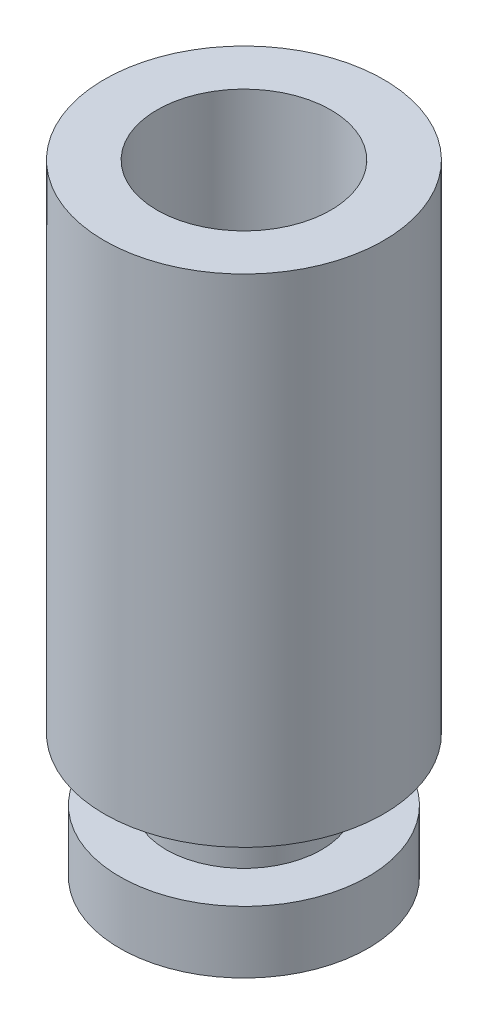
ISO-10303-21;
HEADER;
FILE_DESCRIPTION(('STEP AP214'),'2;1');
FILE_NAME('part.step','',(''),(''),'','','');
FILE_SCHEMA(('AUTOMOTIVE_DESIGN { 1 0 10303 214 1 1 1 1 }'));
ENDSEC;
DATA;
#1=APPLICATION_CONTEXT('core data for automotive mechanical design processes');
#2=APPLICATION_PROTOCOL_DEFINITION('international standard','automotive_design',2000,#1);
#3=PRODUCT_CONTEXT('',#1,'mechanical');
#4=PRODUCT('Part','Part','',(#3));
#5=PRODUCT_RELATED_PRODUCT_CATEGORY('part','',(#4));
#6=PRODUCT_DEFINITION_FORMATION('','',#4);
#7=PRODUCT_DEFINITION_CONTEXT('part definition',#1,'design');
#8=PRODUCT_DEFINITION('design','',#6,#7);
#9=PRODUCT_DEFINITION_SHAPE('','',#8);
#10=(LENGTH_UNIT() NAMED_UNIT(*) SI_UNIT(.MILLI.,.METRE.));
#11=(NAMED_UNIT(*) PLANE_ANGLE_UNIT() SI_UNIT($,.RADIAN.));
#12=(NAMED_UNIT(*) SI_UNIT($,.STERADIAN.) SOLID_ANGLE_UNIT());
#13=UNCERTAINTY_MEASURE_WITH_UNIT(LENGTH_MEASURE(1.E-05),#10,'distance_accuracy_value','');
#14=(GEOMETRIC_REPRESENTATION_CONTEXT(3) GLOBAL_UNCERTAINTY_ASSIGNED_CONTEXT((#13)) GLOBAL_UNIT_ASSIGNED_CONTEXT((#10,
#11,#12)) REPRESENTATION_CONTEXT('',''));
#15=CARTESIAN_POINT('',(0.,0.,0.));
#16=DIRECTION('',(0.,0.,1.));
#17=DIRECTION('',(1.,0.,0.));
#18=AXIS2_PLACEMENT_3D('',#15,#16,#17);
#19=CARTESIAN_POINT('',(-0.522013311509166,8.,-0.51113803418606));
#20=DIRECTION('',(0.,-1.,0.));
#21=DIRECTION('',(0.,0.,-1.));
#22=AXIS2_PLACEMENT_3D('',#19,#20,#21);
#23=CYLINDRICAL_SURFACE('',#22,2.25);
#24=CARTESIAN_POINT('',(-0.522013311509166,8.,-0.51113803418606));
#25=DIRECTION('',(0.,1.,0.));
#26=DIRECTION('',(0.,0.,1.));
#27=AXIS2_PLACEMENT_3D('',#24,#25,#26);
#28=CIRCLE('',#27,2.25);
#29=CARTESIAN_POINT('',(-0.522013311509166,8.,1.73886196581394));
#30=VERTEX_POINT('',#29);
#31=EDGE_CURVE('E53',#30,#30,#28,.T.);
#32=ORIENTED_EDGE('',*,*,#31,.F.);
#33=EDGE_LOOP('',(#32));
#34=FACE_BOUND('',#33,.T.);
#35=CARTESIAN_POINT('',(-0.522013311509166,0.,-0.51113803418606));
#36=DIRECTION('',(0.,1.,0.));
#37=DIRECTION('',(0.,0.,1.));
#38=AXIS2_PLACEMENT_3D('',#35,#36,#37);
#39=CIRCLE('',#38,2.25);
#40=CARTESIAN_POINT('',(-0.522013311509166,0.,1.73886196581394));
#41=VERTEX_POINT('',#40);
#42=EDGE_CURVE('E48',#41,#41,#39,.T.);
#43=ORIENTED_EDGE('',*,*,#42,.T.);
#44=EDGE_LOOP('',(#43));
#45=FACE_BOUND('',#44,.T.);
#46=ADVANCED_FACE('F45',(#34,#45),#23,.T.);
#47=CARTESIAN_POINT('',(-0.522013311509166,8.,-0.51113803418606));
#48=DIRECTION('',(0.,1.,0.));
#49=DIRECTION('',(0.,0.,1.));
#50=AXIS2_PLACEMENT_3D('',#47,#48,#49);
#51=PLANE('',#50);
#52=CARTESIAN_POINT('',(-0.522013311509166,8.,-0.51113803418606));
#53=DIRECTION('',(0.,1.,0.));
#54=DIRECTION('',(0.,0.,1.));
#55=AXIS2_PLACEMENT_3D('',#52,#53,#54);
#56=CIRCLE('',#55,1.4);
#57=CARTESIAN_POINT('',(-0.522013311509166,8.,0.88886196581394));
#58=VERTEX_POINT('',#57);
#59=EDGE_CURVE('E73',#58,#58,#56,.T.);
#60=ORIENTED_EDGE('',*,*,#59,.F.);
#61=EDGE_LOOP('',(#60));
#62=FACE_BOUND('',#61,.T.);
#63=ORIENTED_EDGE('',*,*,#31,.T.);
#64=EDGE_LOOP('',(#63));
#65=FACE_BOUND('',#64,.T.);
#66=ADVANCED_FACE('F90',(#62,#65),#51,.T.);
#67=CARTESIAN_POINT('',(-0.522013311509166,0.,-0.51113803418606));
#68=DIRECTION('',(0.,1.,0.));
#69=DIRECTION('',(0.,0.,1.));
#70=AXIS2_PLACEMENT_3D('',#67,#68,#69);
#71=PLANE('',#70);
#72=CARTESIAN_POINT('',(-0.522013311509166,0.,-0.51113803418606));
#73=DIRECTION('',(0.,-1.,0.));
#74=DIRECTION('',(0.,0.,-1.));
#75=AXIS2_PLACEMENT_3D('',#72,#73,#74);
#76=CIRCLE('',#75,1.25);
#77=CARTESIAN_POINT('',(-0.522013311509166,0.,-1.76113803418606));
#78=VERTEX_POINT('',#77);
#79=EDGE_CURVE('E10',#78,#78,#76,.T.);
#80=ORIENTED_EDGE('',*,*,#79,.F.);
#81=EDGE_LOOP('',(#80));
#82=FACE_BOUND('',#81,.T.);
#83=ORIENTED_EDGE('',*,*,#42,.F.);
#84=EDGE_LOOP('',(#83));
#85=FACE_BOUND('',#84,.T.);
#86=ADVANCED_FACE('F93',(#82,#85),#71,.F.);
#87=CARTESIAN_POINT('',(-0.522013311509166,-1.,-0.51113803418606));
#88=DIRECTION('',(0.,1.,0.));
#89=DIRECTION('',(0.,0.,1.));
#90=AXIS2_PLACEMENT_3D('',#87,#88,#89);
#91=CYLINDRICAL_SURFACE('',#90,1.25);
#92=CARTESIAN_POINT('',(-0.522013311509166,-1.,-0.51113803418606));
#93=DIRECTION('',(0.,-1.,0.));
#94=DIRECTION('',(0.,0.,-1.));
#95=AXIS2_PLACEMENT_3D('',#92,#93,#94);
#96=CIRCLE('',#95,1.25);
#97=CARTESIAN_POINT('',(-0.522013311509166,-1.,-1.76113803418606));
#98=VERTEX_POINT('',#97);
#99=EDGE_CURVE('E60',#98,#98,#96,.T.);
#100=ORIENTED_EDGE('',*,*,#99,.F.);
#101=EDGE_LOOP('',(#100));
#102=FACE_BOUND('',#101,.T.);
#103=ORIENTED_EDGE('',*,*,#79,.T.);
#104=EDGE_LOOP('',(#103));
#105=FACE_BOUND('',#104,.T.);
#106=ADVANCED_FACE('F104',(#102,#105),#91,.T.);
#107=CARTESIAN_POINT('',(-0.522013311509166,-2.,-0.51113803418606));
#108=DIRECTION('',(0.,1.,0.));
#109=DIRECTION('',(0.,0.,1.));
#110=AXIS2_PLACEMENT_3D('',#107,#108,#109);
#111=CYLINDRICAL_SURFACE('',#110,2.);
#112=CARTESIAN_POINT('',(-0.522013311509166,-2.,-0.51113803418606));
#113=DIRECTION('',(0.,-1.,0.));
#114=DIRECTION('',(0.,0.,-1.));
#115=AXIS2_PLACEMENT_3D('',#112,#113,#114);
#116=CIRCLE('',#115,2.);
#117=CARTESIAN_POINT('',(-0.522013311509166,-2.,-2.51113803418606));
#118=VERTEX_POINT('',#117);
#119=EDGE_CURVE('E64',#118,#118,#116,.T.);
#120=ORIENTED_EDGE('',*,*,#119,.F.);
#121=EDGE_LOOP('',(#120));
#122=FACE_BOUND('',#121,.T.);
#123=CARTESIAN_POINT('',(-0.522013311509166,-1.,-0.51113803418606));
#124=DIRECTION('',(0.,-1.,0.));
#125=DIRECTION('',(0.,0.,-1.));
#126=AXIS2_PLACEMENT_3D('',#123,#124,#125);
#127=CIRCLE('',#126,2.);
#128=CARTESIAN_POINT('',(-0.522013311509166,-1.,-2.51113803418606));
#129=VERTEX_POINT('',#128);
#130=EDGE_CURVE('E65',#129,#129,#127,.T.);
#131=ORIENTED_EDGE('',*,*,#130,.T.);
#132=EDGE_LOOP('',(#131));
#133=FACE_BOUND('',#132,.T.);
#134=ADVANCED_FACE('F109',(#122,#133),#111,.T.);
#135=CARTESIAN_POINT('',(-0.522013311509166,-2.,-0.51113803418606));
#136=DIRECTION('',(0.,-1.,0.));
#137=DIRECTION('',(0.,0.,-1.));
#138=AXIS2_PLACEMENT_3D('',#135,#136,#137);
#139=PLANE('',#138);
#140=ORIENTED_EDGE('',*,*,#119,.T.);
#141=EDGE_LOOP('',(#140));
#142=FACE_BOUND('',#141,.T.);
#143=ADVANCED_FACE('F115',(#142),#139,.T.);
#144=CARTESIAN_POINT('',(-0.522013311509166,-1.,-0.51113803418606));
#145=DIRECTION('',(0.,-1.,0.));
#146=DIRECTION('',(0.,0.,-1.));
#147=AXIS2_PLACEMENT_3D('',#144,#145,#146);
#148=PLANE('',#147);
#149=ORIENTED_EDGE('',*,*,#99,.T.);
#150=EDGE_LOOP('',(#149));
#151=FACE_BOUND('',#150,.T.);
#152=ORIENTED_EDGE('',*,*,#130,.F.);
#153=EDGE_LOOP('',(#152));
#154=FACE_BOUND('',#153,.T.);
#155=ADVANCED_FACE('F86',(#151,#154),#148,.F.);
#156=CARTESIAN_POINT('',(-0.522013311509166,0.5,-0.51113803418606));
#157=DIRECTION('',(0.,1.,0.));
#158=DIRECTION('',(0.,0.,1.));
#159=AXIS2_PLACEMENT_3D('',#156,#157,#158);
#160=CYLINDRICAL_SURFACE('',#159,1.4);
#161=CARTESIAN_POINT('',(-0.522013311509166,0.5,-0.51113803418606));
#162=DIRECTION('',(0.,1.,0.));
#163=DIRECTION('',(0.,0.,1.));
#164=AXIS2_PLACEMENT_3D('',#161,#162,#163);
#165=CIRCLE('',#164,1.4);
#166=CARTESIAN_POINT('',(-0.522013311509166,0.5,0.88886196581394));
#167=VERTEX_POINT('',#166);
#168=EDGE_CURVE('E69',#167,#167,#165,.T.);
#169=ORIENTED_EDGE('',*,*,#168,.F.);
#170=EDGE_LOOP('',(#169));
#171=FACE_BOUND('',#170,.T.);
#172=ORIENTED_EDGE('',*,*,#59,.T.);
#173=EDGE_LOOP('',(#172));
#174=FACE_BOUND('',#173,.T.);
#175=ADVANCED_FACE('F83',(#171,#174),#160,.F.);
#176=CARTESIAN_POINT('',(-0.522013311509166,0.5,-0.51113803418606));
#177=DIRECTION('',(0.,1.,0.));
#178=DIRECTION('',(0.,0.,1.));
#179=AXIS2_PLACEMENT_3D('',#176,#177,#178);
#180=PLANE('',#179);
#181=ORIENTED_EDGE('',*,*,#168,.T.);
#182=EDGE_LOOP('',(#181));
#183=FACE_BOUND('',#182,.T.);
#184=ADVANCED_FACE('F81',(#183),#180,.T.);
#185=CLOSED_SHELL('',(#46,#66,#86,#106,#134,#143,#155,#175,#184));
#186=MANIFOLD_SOLID_BREP('B2',#185);
#187=ADVANCED_BREP_SHAPE_REPRESENTATION('',(#18,#186),#14);
#188=SHAPE_DEFINITION_REPRESENTATION(#9,#187);
ENDSEC;
END-ISO-10303-21;
